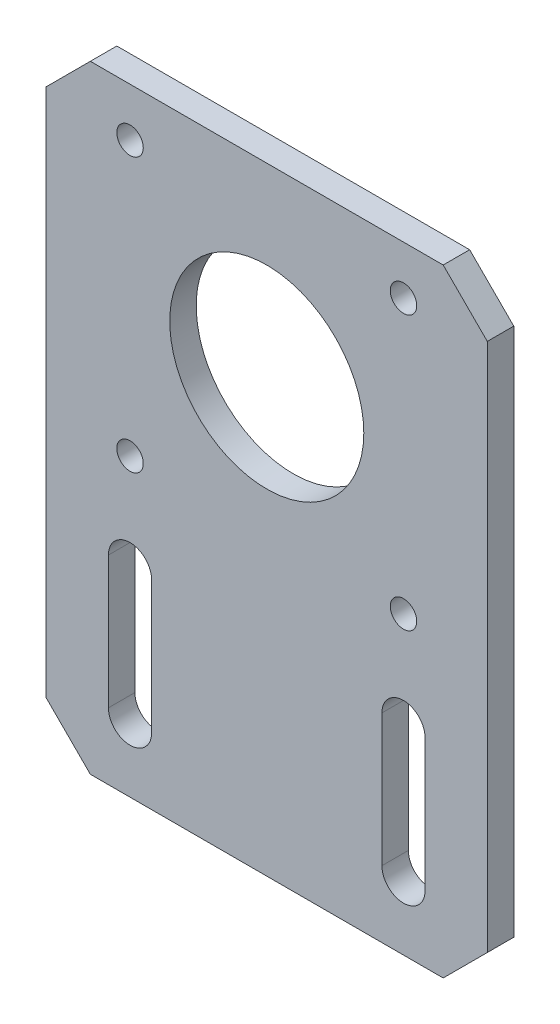
ISO-10303-21;
HEADER;
FILE_DESCRIPTION(('STEP AP214'),'2;1');
FILE_NAME('part.step','',(''),(''),'','','');
FILE_SCHEMA(('AUTOMOTIVE_DESIGN { 1 0 10303 214 1 1 1 1 }'));
ENDSEC;
DATA;
#1=APPLICATION_CONTEXT('core data for automotive mechanical design processes');
#2=APPLICATION_PROTOCOL_DEFINITION('international standard','automotive_design',2000,#1);
#3=PRODUCT_CONTEXT('',#1,'mechanical');
#4=PRODUCT('Part','Part','',(#3));
#5=PRODUCT_RELATED_PRODUCT_CATEGORY('part','',(#4));
#6=PRODUCT_DEFINITION_FORMATION('','',#4);
#7=PRODUCT_DEFINITION_CONTEXT('part definition',#1,'design');
#8=PRODUCT_DEFINITION('design','',#6,#7);
#9=PRODUCT_DEFINITION_SHAPE('','',#8);
#10=(LENGTH_UNIT() NAMED_UNIT(*) SI_UNIT(.MILLI.,.METRE.));
#11=(NAMED_UNIT(*) PLANE_ANGLE_UNIT() SI_UNIT($,.RADIAN.));
#12=(NAMED_UNIT(*) SI_UNIT($,.STERADIAN.) SOLID_ANGLE_UNIT());
#13=UNCERTAINTY_MEASURE_WITH_UNIT(LENGTH_MEASURE(1.E-05),#10,'distance_accuracy_value','');
#14=(GEOMETRIC_REPRESENTATION_CONTEXT(3) GLOBAL_UNCERTAINTY_ASSIGNED_CONTEXT((#13)) GLOBAL_UNIT_ASSIGNED_CONTEXT((#10,
#11,#12)) REPRESENTATION_CONTEXT('',''));
#15=CARTESIAN_POINT('',(0.,0.,0.));
#16=DIRECTION('',(0.,0.,1.));
#17=DIRECTION('',(1.,0.,0.));
#18=AXIS2_PLACEMENT_3D('',#15,#16,#17);
#19=CARTESIAN_POINT('',(0.,0.,3.));
#20=DIRECTION('',(0.,0.,1.));
#21=DIRECTION('',(1.,0.,0.));
#22=AXIS2_PLACEMENT_3D('',#19,#20,#21);
#23=PLANE('',#22);
#24=CARTESIAN_POINT('',(-15.5,-15.5,3.));
#25=DIRECTION('',(0.,0.,1.));
#26=DIRECTION('',(-1.,0.,0.));
#27=AXIS2_PLACEMENT_3D('',#24,#25,#26);
#28=CIRCLE('',#27,1.5);
#29=CARTESIAN_POINT('',(-17.,-15.5,3.));
#30=VERTEX_POINT('',#29);
#31=EDGE_CURVE('E224',#30,#30,#28,.T.);
#32=ORIENTED_EDGE('',*,*,#31,.F.);
#33=EDGE_LOOP('',(#32));
#34=FACE_BOUND('',#33,.T.);
#35=CARTESIAN_POINT('',(-15.5,15.5,3.));
#36=DIRECTION('',(0.,0.,1.));
#37=DIRECTION('',(1.,0.,0.));
#38=AXIS2_PLACEMENT_3D('',#35,#36,#37);
#39=CIRCLE('',#38,1.5);
#40=CARTESIAN_POINT('',(-14.,15.5,3.));
#41=VERTEX_POINT('',#40);
#42=EDGE_CURVE('E236',#41,#41,#39,.T.);
#43=ORIENTED_EDGE('',*,*,#42,.F.);
#44=EDGE_LOOP('',(#43));
#45=FACE_BOUND('',#44,.T.);
#46=DIRECTION('',(-0.707106781186548,0.707106781186548,0.));
#47=VECTOR('',#46,1.);
#48=CARTESIAN_POINT('',(25.,16.,3.));
#49=LINE('',#48,#47);
#50=CARTESIAN_POINT('',(25.,16.,3.));
#51=VERTEX_POINT('',#50);
#52=CARTESIAN_POINT('',(20.,21.,3.));
#53=VERTEX_POINT('',#52);
#54=EDGE_CURVE('E248',#51,#53,#49,.T.);
#55=ORIENTED_EDGE('',*,*,#54,.T.);
#56=DIRECTION('',(-1.,0.,0.));
#57=VECTOR('',#56,1.);
#58=CARTESIAN_POINT('',(20.,21.,3.));
#59=LINE('',#58,#57);
#60=CARTESIAN_POINT('',(-20.,21.,3.));
#61=VERTEX_POINT('',#60);
#62=EDGE_CURVE('E251',#53,#61,#59,.T.);
#63=ORIENTED_EDGE('',*,*,#62,.T.);
#64=DIRECTION('',(-0.707106781186547,-0.707106781186548,0.));
#65=VECTOR('',#64,1.);
#66=CARTESIAN_POINT('',(-20.,21.,3.));
#67=LINE('',#66,#65);
#68=CARTESIAN_POINT('',(-25.,16.,3.));
#69=VERTEX_POINT('',#68);
#70=EDGE_CURVE('E254',#61,#69,#67,.T.);
#71=ORIENTED_EDGE('',*,*,#70,.T.);
#72=DIRECTION('',(0.,-1.,0.));
#73=VECTOR('',#72,1.);
#74=CARTESIAN_POINT('',(-25.,-44.,3.));
#75=LINE('',#74,#73);
#76=CARTESIAN_POINT('',(-25.,-44.,3.));
#77=VERTEX_POINT('',#76);
#78=EDGE_CURVE('E256',#69,#77,#75,.T.);
#79=ORIENTED_EDGE('',*,*,#78,.T.);
#80=DIRECTION('',(0.707106781186548,-0.707106781186547,0.));
#81=VECTOR('',#80,1.);
#82=CARTESIAN_POINT('',(-20.,-49.,3.));
#83=LINE('',#82,#81);
#84=CARTESIAN_POINT('',(-20.,-49.,3.));
#85=VERTEX_POINT('',#84);
#86=EDGE_CURVE('E258',#77,#85,#83,.T.);
#87=ORIENTED_EDGE('',*,*,#86,.T.);
#88=DIRECTION('',(1.,0.,0.));
#89=VECTOR('',#88,1.);
#90=CARTESIAN_POINT('',(20.,-49.,3.));
#91=LINE('',#90,#89);
#92=CARTESIAN_POINT('',(20.,-49.,3.));
#93=VERTEX_POINT('',#92);
#94=EDGE_CURVE('E260',#85,#93,#91,.T.);
#95=ORIENTED_EDGE('',*,*,#94,.T.);
#96=DIRECTION('',(0.707106781186548,0.707106781186547,0.));
#97=VECTOR('',#96,1.);
#98=CARTESIAN_POINT('',(25.,-44.,3.));
#99=LINE('',#98,#97);
#100=CARTESIAN_POINT('',(25.,-44.,3.));
#101=VERTEX_POINT('',#100);
#102=EDGE_CURVE('E262',#93,#101,#99,.T.);
#103=ORIENTED_EDGE('',*,*,#102,.T.);
#104=DIRECTION('',(0.,1.,0.));
#105=VECTOR('',#104,1.);
#106=CARTESIAN_POINT('',(25.,-44.,3.));
#107=LINE('',#106,#105);
#108=EDGE_CURVE('E264',#101,#51,#107,.T.);
#109=ORIENTED_EDGE('',*,*,#108,.T.);
#110=EDGE_LOOP('',(#55,#63,#71,#79,#87,#95,#103,#109));
#111=FACE_BOUND('',#110,.T.);
#112=CARTESIAN_POINT('',(0.,0.,3.));
#113=DIRECTION('',(0.,0.,1.));
#114=DIRECTION('',(1.,0.,0.));
#115=AXIS2_PLACEMENT_3D('',#112,#113,#114);
#116=CIRCLE('',#115,11.);
#117=CARTESIAN_POINT('',(11.,0.,3.));
#118=VERTEX_POINT('',#117);
#119=EDGE_CURVE('E242',#118,#118,#116,.T.);
#120=ORIENTED_EDGE('',*,*,#119,.F.);
#121=EDGE_LOOP('',(#120));
#122=FACE_BOUND('',#121,.T.);
#123=CARTESIAN_POINT('',(15.5,15.5,3.));
#124=DIRECTION('',(0.,0.,1.));
#125=DIRECTION('',(-1.,0.,0.));
#126=AXIS2_PLACEMENT_3D('',#123,#124,#125);
#127=CIRCLE('',#126,1.5);
#128=CARTESIAN_POINT('',(14.,15.5,3.));
#129=VERTEX_POINT('',#128);
#130=EDGE_CURVE('E230',#129,#129,#127,.T.);
#131=ORIENTED_EDGE('',*,*,#130,.F.);
#132=EDGE_LOOP('',(#131));
#133=FACE_BOUND('',#132,.T.);
#134=CARTESIAN_POINT('',(15.5,-15.5,3.));
#135=DIRECTION('',(0.,0.,1.));
#136=DIRECTION('',(1.,0.,0.));
#137=AXIS2_PLACEMENT_3D('',#134,#135,#136);
#138=CIRCLE('',#137,1.5);
#139=CARTESIAN_POINT('',(17.,-15.5,3.));
#140=VERTEX_POINT('',#139);
#141=EDGE_CURVE('E218',#140,#140,#138,.T.);
#142=ORIENTED_EDGE('',*,*,#141,.F.);
#143=EDGE_LOOP('',(#142));
#144=FACE_BOUND('',#143,.T.);
#145=DIRECTION('',(0.,-1.,0.));
#146=VECTOR('',#145,1.);
#147=CARTESIAN_POINT('',(-17.95,-26.45,3.));
#148=LINE('',#147,#146);
#149=CARTESIAN_POINT('',(-17.95,-26.45,3.));
#150=VERTEX_POINT('',#149);
#151=CARTESIAN_POINT('',(-17.95,-41.45,3.));
#152=VERTEX_POINT('',#151);
#153=EDGE_CURVE('E189',#150,#152,#148,.T.);
#154=ORIENTED_EDGE('',*,*,#153,.F.);
#155=CARTESIAN_POINT('',(-15.5,-26.45,3.));
#156=DIRECTION('',(0.,0.,1.));
#157=DIRECTION('',(1.,0.,0.));
#158=AXIS2_PLACEMENT_3D('',#155,#156,#157);
#159=CIRCLE('',#158,2.45000000000001);
#160=CARTESIAN_POINT('',(-13.05,-26.45,3.));
#161=VERTEX_POINT('',#160);
#162=EDGE_CURVE('E187',#161,#150,#159,.T.);
#163=ORIENTED_EDGE('',*,*,#162,.F.);
#164=DIRECTION('',(0.,1.,0.));
#165=VECTOR('',#164,1.);
#166=CARTESIAN_POINT('',(-13.05,-26.45,3.));
#167=LINE('',#166,#165);
#168=CARTESIAN_POINT('',(-13.05,-41.45,3.));
#169=VERTEX_POINT('',#168);
#170=EDGE_CURVE('E195',#169,#161,#167,.T.);
#171=ORIENTED_EDGE('',*,*,#170,.F.);
#172=CARTESIAN_POINT('',(-15.5,-41.45,3.));
#173=DIRECTION('',(0.,0.,1.));
#174=DIRECTION('',(1.,0.,0.));
#175=AXIS2_PLACEMENT_3D('',#172,#173,#174);
#176=CIRCLE('',#175,2.45000000000002);
#177=EDGE_CURVE('E192',#152,#169,#176,.T.);
#178=ORIENTED_EDGE('',*,*,#177,.F.);
#179=EDGE_LOOP('',(#154,#163,#171,#178));
#180=FACE_BOUND('',#179,.T.);
#181=DIRECTION('',(0.,-1.,0.));
#182=VECTOR('',#181,1.);
#183=CARTESIAN_POINT('',(13.05,-26.45,3.));
#184=LINE('',#183,#182);
#185=CARTESIAN_POINT('',(13.05,-26.45,3.));
#186=VERTEX_POINT('',#185);
#187=CARTESIAN_POINT('',(13.05,-41.45,3.));
#188=VERTEX_POINT('',#187);
#189=EDGE_CURVE('E159',#186,#188,#184,.T.);
#190=ORIENTED_EDGE('',*,*,#189,.F.);
#191=CARTESIAN_POINT('',(15.5,-26.45,3.));
#192=DIRECTION('',(0.,0.,1.));
#193=DIRECTION('',(-1.,0.,0.));
#194=AXIS2_PLACEMENT_3D('',#191,#192,#193);
#195=CIRCLE('',#194,2.45000000000002);
#196=CARTESIAN_POINT('',(17.95,-26.45,3.));
#197=VERTEX_POINT('',#196);
#198=EDGE_CURVE('E151',#197,#186,#195,.T.);
#199=ORIENTED_EDGE('',*,*,#198,.F.);
#200=DIRECTION('',(0.,1.,0.));
#201=VECTOR('',#200,1.);
#202=CARTESIAN_POINT('',(17.95,-26.45,3.));
#203=LINE('',#202,#201);
#204=CARTESIAN_POINT('',(17.95,-41.45,3.));
#205=VERTEX_POINT('',#204);
#206=EDGE_CURVE('E173',#205,#197,#203,.T.);
#207=ORIENTED_EDGE('',*,*,#206,.F.);
#208=CARTESIAN_POINT('',(15.5,-41.45,3.));
#209=DIRECTION('',(0.,0.,1.));
#210=DIRECTION('',(-1.,0.,0.));
#211=AXIS2_PLACEMENT_3D('',#208,#209,#210);
#212=CIRCLE('',#211,2.45000000000002);
#213=EDGE_CURVE('E171',#188,#205,#212,.T.);
#214=ORIENTED_EDGE('',*,*,#213,.F.);
#215=EDGE_LOOP('',(#190,#199,#207,#214));
#216=FACE_BOUND('',#215,.T.);
#217=ADVANCED_FACE('F38',(#34,#45,#111,#122,#133,#144,#180,#216),#23,.T.);
#218=CARTESIAN_POINT('',(0.,0.,0.));
#219=DIRECTION('',(0.,0.,1.));
#220=DIRECTION('',(1.,0.,0.));
#221=AXIS2_PLACEMENT_3D('',#218,#219,#220);
#222=PLANE('',#221);
#223=CARTESIAN_POINT('',(-15.5,-26.45,0.));
#224=DIRECTION('',(0.,0.,1.));
#225=DIRECTION('',(1.,0.,0.));
#226=AXIS2_PLACEMENT_3D('',#223,#224,#225);
#227=CIRCLE('',#226,2.45000000000001);
#228=CARTESIAN_POINT('',(-13.05,-26.45,0.));
#229=VERTEX_POINT('',#228);
#230=CARTESIAN_POINT('',(-17.95,-26.45,0.));
#231=VERTEX_POINT('',#230);
#232=EDGE_CURVE('E167',#229,#231,#227,.T.);
#233=ORIENTED_EDGE('',*,*,#232,.T.);
#234=DIRECTION('',(0.,-1.,0.));
#235=VECTOR('',#234,1.);
#236=CARTESIAN_POINT('',(-17.95,-26.45,0.));
#237=LINE('',#236,#235);
#238=CARTESIAN_POINT('',(-17.95,-41.45,0.));
#239=VERTEX_POINT('',#238);
#240=EDGE_CURVE('E200',#231,#239,#237,.T.);
#241=ORIENTED_EDGE('',*,*,#240,.T.);
#242=CARTESIAN_POINT('',(-15.5,-41.45,0.));
#243=DIRECTION('',(0.,0.,1.));
#244=DIRECTION('',(1.,0.,0.));
#245=AXIS2_PLACEMENT_3D('',#242,#243,#244);
#246=CIRCLE('',#245,2.45000000000002);
#247=CARTESIAN_POINT('',(-13.05,-41.45,0.));
#248=VERTEX_POINT('',#247);
#249=EDGE_CURVE('E203',#239,#248,#246,.T.);
#250=ORIENTED_EDGE('',*,*,#249,.T.);
#251=DIRECTION('',(0.,1.,0.));
#252=VECTOR('',#251,1.);
#253=CARTESIAN_POINT('',(-13.05,-26.45,0.));
#254=LINE('',#253,#252);
#255=EDGE_CURVE('E190',#248,#229,#254,.T.);
#256=ORIENTED_EDGE('',*,*,#255,.T.);
#257=EDGE_LOOP('',(#233,#241,#250,#256));
#258=FACE_BOUND('',#257,.T.);
#259=DIRECTION('',(-0.707106781186548,0.707106781186548,0.));
#260=VECTOR('',#259,1.);
#261=CARTESIAN_POINT('',(25.,16.,0.));
#262=LINE('',#261,#260);
#263=CARTESIAN_POINT('',(25.,16.,0.));
#264=VERTEX_POINT('',#263);
#265=CARTESIAN_POINT('',(20.,21.,0.));
#266=VERTEX_POINT('',#265);
#267=EDGE_CURVE('E245',#264,#266,#262,.T.);
#268=ORIENTED_EDGE('',*,*,#267,.F.);
#269=DIRECTION('',(0.,1.,0.));
#270=VECTOR('',#269,1.);
#271=CARTESIAN_POINT('',(25.,-44.,0.));
#272=LINE('',#271,#270);
#273=CARTESIAN_POINT('',(25.,-44.,0.));
#274=VERTEX_POINT('',#273);
#275=EDGE_CURVE('E252',#274,#264,#272,.T.);
#276=ORIENTED_EDGE('',*,*,#275,.F.);
#277=DIRECTION('',(0.707106781186548,0.707106781186547,0.));
#278=VECTOR('',#277,1.);
#279=CARTESIAN_POINT('',(25.,-44.,0.));
#280=LINE('',#279,#278);
#281=CARTESIAN_POINT('',(20.,-49.,0.));
#282=VERTEX_POINT('',#281);
#283=EDGE_CURVE('E279',#282,#274,#280,.T.);
#284=ORIENTED_EDGE('',*,*,#283,.F.);
#285=DIRECTION('',(1.,0.,0.));
#286=VECTOR('',#285,1.);
#287=CARTESIAN_POINT('',(20.,-49.,0.));
#288=LINE('',#287,#286);
#289=CARTESIAN_POINT('',(-20.,-49.,0.));
#290=VERTEX_POINT('',#289);
#291=EDGE_CURVE('E277',#290,#282,#288,.T.);
#292=ORIENTED_EDGE('',*,*,#291,.F.);
#293=DIRECTION('',(0.707106781186548,-0.707106781186547,0.));
#294=VECTOR('',#293,1.);
#295=CARTESIAN_POINT('',(-20.,-49.,0.));
#296=LINE('',#295,#294);
#297=CARTESIAN_POINT('',(-25.,-44.,0.));
#298=VERTEX_POINT('',#297);
#299=EDGE_CURVE('E275',#298,#290,#296,.T.);
#300=ORIENTED_EDGE('',*,*,#299,.F.);
#301=DIRECTION('',(0.,-1.,0.));
#302=VECTOR('',#301,1.);
#303=CARTESIAN_POINT('',(-25.,-44.,0.));
#304=LINE('',#303,#302);
#305=CARTESIAN_POINT('',(-25.,16.,0.));
#306=VERTEX_POINT('',#305);
#307=EDGE_CURVE('E273',#306,#298,#304,.T.);
#308=ORIENTED_EDGE('',*,*,#307,.F.);
#309=DIRECTION('',(-0.707106781186547,-0.707106781186548,0.));
#310=VECTOR('',#309,1.);
#311=CARTESIAN_POINT('',(-20.,21.,0.));
#312=LINE('',#311,#310);
#313=CARTESIAN_POINT('',(-20.,21.,0.));
#314=VERTEX_POINT('',#313);
#315=EDGE_CURVE('E271',#314,#306,#312,.T.);
#316=ORIENTED_EDGE('',*,*,#315,.F.);
#317=DIRECTION('',(-1.,0.,0.));
#318=VECTOR('',#317,1.);
#319=CARTESIAN_POINT('',(20.,21.,0.));
#320=LINE('',#319,#318);
#321=EDGE_CURVE('E269',#266,#314,#320,.T.);
#322=ORIENTED_EDGE('',*,*,#321,.F.);
#323=EDGE_LOOP('',(#268,#276,#284,#292,#300,#308,#316,#322));
#324=FACE_BOUND('',#323,.T.);
#325=CARTESIAN_POINT('',(0.,0.,0.));
#326=DIRECTION('',(0.,0.,1.));
#327=DIRECTION('',(1.,0.,0.));
#328=AXIS2_PLACEMENT_3D('',#325,#326,#327);
#329=CIRCLE('',#328,11.);
#330=CARTESIAN_POINT('',(11.,0.,0.));
#331=VERTEX_POINT('',#330);
#332=EDGE_CURVE('E239',#331,#331,#329,.T.);
#333=ORIENTED_EDGE('',*,*,#332,.T.);
#334=EDGE_LOOP('',(#333));
#335=FACE_BOUND('',#334,.T.);
#336=CARTESIAN_POINT('',(-15.5,15.5,0.));
#337=DIRECTION('',(0.,0.,1.));
#338=DIRECTION('',(1.,0.,0.));
#339=AXIS2_PLACEMENT_3D('',#336,#337,#338);
#340=CIRCLE('',#339,1.5);
#341=CARTESIAN_POINT('',(-14.,15.5,0.));
#342=VERTEX_POINT('',#341);
#343=EDGE_CURVE('E233',#342,#342,#340,.T.);
#344=ORIENTED_EDGE('',*,*,#343,.T.);
#345=EDGE_LOOP('',(#344));
#346=FACE_BOUND('',#345,.T.);
#347=CARTESIAN_POINT('',(15.5,15.5,0.));
#348=DIRECTION('',(0.,0.,1.));
#349=DIRECTION('',(-1.,0.,0.));
#350=AXIS2_PLACEMENT_3D('',#347,#348,#349);
#351=CIRCLE('',#350,1.5);
#352=CARTESIAN_POINT('',(14.,15.5,0.));
#353=VERTEX_POINT('',#352);
#354=EDGE_CURVE('E227',#353,#353,#351,.T.);
#355=ORIENTED_EDGE('',*,*,#354,.T.);
#356=EDGE_LOOP('',(#355));
#357=FACE_BOUND('',#356,.T.);
#358=CARTESIAN_POINT('',(-15.5,-15.5,0.));
#359=DIRECTION('',(0.,0.,1.));
#360=DIRECTION('',(-1.,0.,0.));
#361=AXIS2_PLACEMENT_3D('',#358,#359,#360);
#362=CIRCLE('',#361,1.5);
#363=CARTESIAN_POINT('',(-17.,-15.5,0.));
#364=VERTEX_POINT('',#363);
#365=EDGE_CURVE('E221',#364,#364,#362,.T.);
#366=ORIENTED_EDGE('',*,*,#365,.T.);
#367=EDGE_LOOP('',(#366));
#368=FACE_BOUND('',#367,.T.);
#369=CARTESIAN_POINT('',(15.5,-15.5,0.));
#370=DIRECTION('',(0.,0.,1.));
#371=DIRECTION('',(1.,0.,0.));
#372=AXIS2_PLACEMENT_3D('',#369,#370,#371);
#373=CIRCLE('',#372,1.5);
#374=CARTESIAN_POINT('',(17.,-15.5,0.));
#375=VERTEX_POINT('',#374);
#376=EDGE_CURVE('E217',#375,#375,#373,.T.);
#377=ORIENTED_EDGE('',*,*,#376,.T.);
#378=EDGE_LOOP('',(#377));
#379=FACE_BOUND('',#378,.T.);
#380=CARTESIAN_POINT('',(15.5,-26.45,0.));
#381=DIRECTION('',(0.,0.,1.));
#382=DIRECTION('',(-1.,0.,0.));
#383=AXIS2_PLACEMENT_3D('',#380,#381,#382);
#384=CIRCLE('',#383,2.45000000000002);
#385=CARTESIAN_POINT('',(17.95,-26.45,0.));
#386=VERTEX_POINT('',#385);
#387=CARTESIAN_POINT('',(13.05,-26.45,0.));
#388=VERTEX_POINT('',#387);
#389=EDGE_CURVE('E61',#386,#388,#384,.T.);
#390=ORIENTED_EDGE('',*,*,#389,.T.);
#391=DIRECTION('',(0.,-1.,0.));
#392=VECTOR('',#391,1.);
#393=CARTESIAN_POINT('',(13.05,-26.45,0.));
#394=LINE('',#393,#392);
#395=CARTESIAN_POINT('',(13.05,-41.45,0.));
#396=VERTEX_POINT('',#395);
#397=EDGE_CURVE('E166',#388,#396,#394,.T.);
#398=ORIENTED_EDGE('',*,*,#397,.T.);
#399=CARTESIAN_POINT('',(15.5,-41.45,0.));
#400=DIRECTION('',(0.,0.,1.));
#401=DIRECTION('',(-1.,0.,0.));
#402=AXIS2_PLACEMENT_3D('',#399,#400,#401);
#403=CIRCLE('',#402,2.45000000000002);
#404=CARTESIAN_POINT('',(17.95,-41.45,0.));
#405=VERTEX_POINT('',#404);
#406=EDGE_CURVE('E179',#396,#405,#403,.T.);
#407=ORIENTED_EDGE('',*,*,#406,.T.);
#408=DIRECTION('',(0.,1.,0.));
#409=VECTOR('',#408,1.);
#410=CARTESIAN_POINT('',(17.95,-26.45,0.));
#411=LINE('',#410,#409);
#412=EDGE_CURVE('E160',#405,#386,#411,.T.);
#413=ORIENTED_EDGE('',*,*,#412,.T.);
#414=EDGE_LOOP('',(#390,#398,#407,#413));
#415=FACE_BOUND('',#414,.T.);
#416=ADVANCED_FACE('F309',(#258,#324,#335,#346,#357,#368,#379,#415),#222,.F.);
#417=CARTESIAN_POINT('',(25.,16.,3.));
#418=DIRECTION('',(-0.707106781186547,-0.707106781186547,0.));
#419=DIRECTION('',(0.707106781186548,-0.707106781186548,0.));
#420=AXIS2_PLACEMENT_3D('',#417,#418,#419);
#421=PLANE('',#420);
#422=ORIENTED_EDGE('',*,*,#267,.T.);
#423=DIRECTION('',(0.,0.,-1.));
#424=VECTOR('',#423,1.);
#425=CARTESIAN_POINT('',(20.,21.,3.));
#426=LINE('',#425,#424);
#427=EDGE_CURVE('E11',#53,#266,#426,.T.);
#428=ORIENTED_EDGE('',*,*,#427,.F.);
#429=ORIENTED_EDGE('',*,*,#54,.F.);
#430=DIRECTION('',(0.,0.,-1.));
#431=VECTOR('',#430,1.);
#432=CARTESIAN_POINT('',(25.,16.,3.));
#433=LINE('',#432,#431);
#434=EDGE_CURVE('E266',#51,#264,#433,.T.);
#435=ORIENTED_EDGE('',*,*,#434,.T.);
#436=EDGE_LOOP('',(#422,#428,#429,#435));
#437=FACE_BOUND('',#436,.T.);
#438=ADVANCED_FACE('F40',(#437),#421,.F.);
#439=CARTESIAN_POINT('',(20.,21.,3.));
#440=DIRECTION('',(0.,-1.,0.));
#441=DIRECTION('',(1.,0.,0.));
#442=AXIS2_PLACEMENT_3D('',#439,#440,#441);
#443=PLANE('',#442);
#444=ORIENTED_EDGE('',*,*,#321,.T.);
#445=DIRECTION('',(0.,0.,-1.));
#446=VECTOR('',#445,1.);
#447=CARTESIAN_POINT('',(-20.,21.,3.));
#448=LINE('',#447,#446);
#449=EDGE_CURVE('E46',#61,#314,#448,.T.);
#450=ORIENTED_EDGE('',*,*,#449,.F.);
#451=ORIENTED_EDGE('',*,*,#62,.F.);
#452=ORIENTED_EDGE('',*,*,#427,.T.);
#453=EDGE_LOOP('',(#444,#450,#451,#452));
#454=FACE_BOUND('',#453,.T.);
#455=ADVANCED_FACE('F327',(#454),#443,.F.);
#456=CARTESIAN_POINT('',(-20.,21.,3.));
#457=DIRECTION('',(0.707106781186548,-0.707106781186547,0.));
#458=DIRECTION('',(0.707106781186547,0.707106781186548,0.));
#459=AXIS2_PLACEMENT_3D('',#456,#457,#458);
#460=PLANE('',#459);
#461=ORIENTED_EDGE('',*,*,#315,.T.);
#462=DIRECTION('',(0.,0.,-1.));
#463=VECTOR('',#462,1.);
#464=CARTESIAN_POINT('',(-25.,16.,3.));
#465=LINE('',#464,#463);
#466=EDGE_CURVE('E296',#69,#306,#465,.T.);
#467=ORIENTED_EDGE('',*,*,#466,.F.);
#468=ORIENTED_EDGE('',*,*,#70,.F.);
#469=ORIENTED_EDGE('',*,*,#449,.T.);
#470=EDGE_LOOP('',(#461,#467,#468,#469));
#471=FACE_BOUND('',#470,.T.);
#472=ADVANCED_FACE('F303',(#471),#460,.F.);
#473=CARTESIAN_POINT('',(-25.,-44.,3.));
#474=DIRECTION('',(1.,0.,0.));
#475=DIRECTION('',(0.,1.,0.));
#476=AXIS2_PLACEMENT_3D('',#473,#474,#475);
#477=PLANE('',#476);
#478=ORIENTED_EDGE('',*,*,#307,.T.);
#479=DIRECTION('',(0.,0.,-1.));
#480=VECTOR('',#479,1.);
#481=CARTESIAN_POINT('',(-25.,-44.,3.));
#482=LINE('',#481,#480);
#483=EDGE_CURVE('E293',#77,#298,#482,.T.);
#484=ORIENTED_EDGE('',*,*,#483,.F.);
#485=ORIENTED_EDGE('',*,*,#78,.F.);
#486=ORIENTED_EDGE('',*,*,#466,.T.);
#487=EDGE_LOOP('',(#478,#484,#485,#486));
#488=FACE_BOUND('',#487,.T.);
#489=ADVANCED_FACE('F315',(#488),#477,.F.);
#490=CARTESIAN_POINT('',(-20.,-49.,3.));
#491=DIRECTION('',(0.707106781186547,0.707106781186548,0.));
#492=DIRECTION('',(-0.707106781186548,0.707106781186547,0.));
#493=AXIS2_PLACEMENT_3D('',#490,#491,#492);
#494=PLANE('',#493);
#495=ORIENTED_EDGE('',*,*,#299,.T.);
#496=DIRECTION('',(0.,0.,-1.));
#497=VECTOR('',#496,1.);
#498=CARTESIAN_POINT('',(-20.,-49.,3.));
#499=LINE('',#498,#497);
#500=EDGE_CURVE('E290',#85,#290,#499,.T.);
#501=ORIENTED_EDGE('',*,*,#500,.F.);
#502=ORIENTED_EDGE('',*,*,#86,.F.);
#503=ORIENTED_EDGE('',*,*,#483,.T.);
#504=EDGE_LOOP('',(#495,#501,#502,#503));
#505=FACE_BOUND('',#504,.T.);
#506=ADVANCED_FACE('F319',(#505),#494,.F.);
#507=CARTESIAN_POINT('',(20.,-49.,3.));
#508=DIRECTION('',(0.,1.,0.));
#509=DIRECTION('',(-1.,0.,0.));
#510=AXIS2_PLACEMENT_3D('',#507,#508,#509);
#511=PLANE('',#510);
#512=ORIENTED_EDGE('',*,*,#291,.T.);
#513=DIRECTION('',(0.,0.,-1.));
#514=VECTOR('',#513,1.);
#515=CARTESIAN_POINT('',(20.,-49.,3.));
#516=LINE('',#515,#514);
#517=EDGE_CURVE('E287',#93,#282,#516,.T.);
#518=ORIENTED_EDGE('',*,*,#517,.F.);
#519=ORIENTED_EDGE('',*,*,#94,.F.);
#520=ORIENTED_EDGE('',*,*,#500,.T.);
#521=EDGE_LOOP('',(#512,#518,#519,#520));
#522=FACE_BOUND('',#521,.T.);
#523=ADVANCED_FACE('F340',(#522),#511,.F.);
#524=CARTESIAN_POINT('',(25.,-44.,3.));
#525=DIRECTION('',(-0.707106781186547,0.707106781186548,0.));
#526=DIRECTION('',(-0.707106781186548,-0.707106781186547,0.));
#527=AXIS2_PLACEMENT_3D('',#524,#525,#526);
#528=PLANE('',#527);
#529=ORIENTED_EDGE('',*,*,#283,.T.);
#530=DIRECTION('',(0.,0.,-1.));
#531=VECTOR('',#530,1.);
#532=CARTESIAN_POINT('',(25.,-44.,3.));
#533=LINE('',#532,#531);
#534=EDGE_CURVE('E284',#101,#274,#533,.T.);
#535=ORIENTED_EDGE('',*,*,#534,.F.);
#536=ORIENTED_EDGE('',*,*,#102,.F.);
#537=ORIENTED_EDGE('',*,*,#517,.T.);
#538=EDGE_LOOP('',(#529,#535,#536,#537));
#539=FACE_BOUND('',#538,.T.);
#540=ADVANCED_FACE('F338',(#539),#528,.F.);
#541=CARTESIAN_POINT('',(25.,-44.,3.));
#542=DIRECTION('',(-1.,0.,0.));
#543=DIRECTION('',(0.,-1.,0.));
#544=AXIS2_PLACEMENT_3D('',#541,#542,#543);
#545=PLANE('',#544);
#546=ORIENTED_EDGE('',*,*,#275,.T.);
#547=ORIENTED_EDGE('',*,*,#434,.F.);
#548=ORIENTED_EDGE('',*,*,#108,.F.);
#549=ORIENTED_EDGE('',*,*,#534,.T.);
#550=EDGE_LOOP('',(#546,#547,#548,#549));
#551=FACE_BOUND('',#550,.T.);
#552=ADVANCED_FACE('F333',(#551),#545,.F.);
#553=CARTESIAN_POINT('',(0.,0.,3.));
#554=DIRECTION('',(0.,0.,-1.));
#555=DIRECTION('',(-1.,0.,0.));
#556=AXIS2_PLACEMENT_3D('',#553,#554,#555);
#557=CYLINDRICAL_SURFACE('',#556,11.);
#558=ORIENTED_EDGE('',*,*,#119,.T.);
#559=EDGE_LOOP('',(#558));
#560=FACE_BOUND('',#559,.T.);
#561=ORIENTED_EDGE('',*,*,#332,.F.);
#562=EDGE_LOOP('',(#561));
#563=FACE_BOUND('',#562,.T.);
#564=ADVANCED_FACE('F360',(#560,#563),#557,.F.);
#565=CARTESIAN_POINT('',(-15.5,15.5,3.));
#566=DIRECTION('',(0.,0.,-1.));
#567=DIRECTION('',(-1.,0.,0.));
#568=AXIS2_PLACEMENT_3D('',#565,#566,#567);
#569=CYLINDRICAL_SURFACE('',#568,1.5);
#570=ORIENTED_EDGE('',*,*,#42,.T.);
#571=EDGE_LOOP('',(#570));
#572=FACE_BOUND('',#571,.T.);
#573=ORIENTED_EDGE('',*,*,#343,.F.);
#574=EDGE_LOOP('',(#573));
#575=FACE_BOUND('',#574,.T.);
#576=ADVANCED_FACE('F367',(#572,#575),#569,.F.);
#577=CARTESIAN_POINT('',(15.5,15.5,3.));
#578=DIRECTION('',(0.,0.,-1.));
#579=DIRECTION('',(-1.,0.,0.));
#580=AXIS2_PLACEMENT_3D('',#577,#578,#579);
#581=CYLINDRICAL_SURFACE('',#580,1.5);
#582=ORIENTED_EDGE('',*,*,#130,.T.);
#583=EDGE_LOOP('',(#582));
#584=FACE_BOUND('',#583,.T.);
#585=ORIENTED_EDGE('',*,*,#354,.F.);
#586=EDGE_LOOP('',(#585));
#587=FACE_BOUND('',#586,.T.);
#588=ADVANCED_FACE('F372',(#584,#587),#581,.F.);
#589=CARTESIAN_POINT('',(-15.5,-15.5,3.));
#590=DIRECTION('',(0.,0.,-1.));
#591=DIRECTION('',(-1.,0.,0.));
#592=AXIS2_PLACEMENT_3D('',#589,#590,#591);
#593=CYLINDRICAL_SURFACE('',#592,1.5);
#594=ORIENTED_EDGE('',*,*,#31,.T.);
#595=EDGE_LOOP('',(#594));
#596=FACE_BOUND('',#595,.T.);
#597=ORIENTED_EDGE('',*,*,#365,.F.);
#598=EDGE_LOOP('',(#597));
#599=FACE_BOUND('',#598,.T.);
#600=ADVANCED_FACE('F420',(#596,#599),#593,.F.);
#601=CARTESIAN_POINT('',(15.5,-15.5,3.));
#602=DIRECTION('',(0.,0.,-1.));
#603=DIRECTION('',(-1.,0.,0.));
#604=AXIS2_PLACEMENT_3D('',#601,#602,#603);
#605=CYLINDRICAL_SURFACE('',#604,1.5);
#606=ORIENTED_EDGE('',*,*,#141,.T.);
#607=EDGE_LOOP('',(#606));
#608=FACE_BOUND('',#607,.T.);
#609=ORIENTED_EDGE('',*,*,#376,.F.);
#610=EDGE_LOOP('',(#609));
#611=FACE_BOUND('',#610,.T.);
#612=ADVANCED_FACE('F416',(#608,#611),#605,.F.);
#613=CARTESIAN_POINT('',(-15.5,-26.45,3.));
#614=DIRECTION('',(0.,0.,-1.));
#615=DIRECTION('',(-1.,0.,0.));
#616=AXIS2_PLACEMENT_3D('',#613,#614,#615);
#617=CYLINDRICAL_SURFACE('',#616,2.45000000000001);
#618=ORIENTED_EDGE('',*,*,#232,.F.);
#619=DIRECTION('',(0.,0.,-1.));
#620=VECTOR('',#619,1.);
#621=CARTESIAN_POINT('',(-13.05,-26.45,3.));
#622=LINE('',#621,#620);
#623=EDGE_CURVE('E197',#161,#229,#622,.T.);
#624=ORIENTED_EDGE('',*,*,#623,.F.);
#625=ORIENTED_EDGE('',*,*,#162,.T.);
#626=DIRECTION('',(0.,0.,-1.));
#627=VECTOR('',#626,1.);
#628=CARTESIAN_POINT('',(-17.95,-26.45,3.));
#629=LINE('',#628,#627);
#630=EDGE_CURVE('E214',#150,#231,#629,.T.);
#631=ORIENTED_EDGE('',*,*,#630,.T.);
#632=EDGE_LOOP('',(#618,#624,#625,#631));
#633=FACE_BOUND('',#632,.T.);
#634=ADVANCED_FACE('F412',(#633),#617,.F.);
#635=CARTESIAN_POINT('',(-17.95,-26.45,3.));
#636=DIRECTION('',(1.,0.,0.));
#637=DIRECTION('',(0.,0.,-1.));
#638=AXIS2_PLACEMENT_3D('',#635,#636,#637);
#639=PLANE('',#638);
#640=ORIENTED_EDGE('',*,*,#240,.F.);
#641=ORIENTED_EDGE('',*,*,#630,.F.);
#642=ORIENTED_EDGE('',*,*,#153,.T.);
#643=DIRECTION('',(0.,0.,-1.));
#644=VECTOR('',#643,1.);
#645=CARTESIAN_POINT('',(-17.95,-41.45,3.));
#646=LINE('',#645,#644);
#647=EDGE_CURVE('E212',#152,#239,#646,.T.);
#648=ORIENTED_EDGE('',*,*,#647,.T.);
#649=EDGE_LOOP('',(#640,#641,#642,#648));
#650=FACE_BOUND('',#649,.T.);
#651=ADVANCED_FACE('F408',(#650),#639,.T.);
#652=CARTESIAN_POINT('',(-15.5,-41.45,3.));
#653=DIRECTION('',(0.,0.,-1.));
#654=DIRECTION('',(-1.,0.,0.));
#655=AXIS2_PLACEMENT_3D('',#652,#653,#654);
#656=CYLINDRICAL_SURFACE('',#655,2.45000000000002);
#657=ORIENTED_EDGE('',*,*,#249,.F.);
#658=ORIENTED_EDGE('',*,*,#647,.F.);
#659=ORIENTED_EDGE('',*,*,#177,.T.);
#660=DIRECTION('',(0.,0.,-1.));
#661=VECTOR('',#660,1.);
#662=CARTESIAN_POINT('',(-13.05,-41.45,3.));
#663=LINE('',#662,#661);
#664=EDGE_CURVE('E210',#169,#248,#663,.T.);
#665=ORIENTED_EDGE('',*,*,#664,.T.);
#666=EDGE_LOOP('',(#657,#658,#659,#665));
#667=FACE_BOUND('',#666,.T.);
#668=ADVANCED_FACE('F404',(#667),#656,.F.);
#669=CARTESIAN_POINT('',(-13.05,-26.45,3.));
#670=DIRECTION('',(-1.,0.,0.));
#671=DIRECTION('',(0.,-1.,0.));
#672=AXIS2_PLACEMENT_3D('',#669,#670,#671);
#673=PLANE('',#672);
#674=ORIENTED_EDGE('',*,*,#255,.F.);
#675=ORIENTED_EDGE('',*,*,#664,.F.);
#676=ORIENTED_EDGE('',*,*,#170,.T.);
#677=ORIENTED_EDGE('',*,*,#623,.T.);
#678=EDGE_LOOP('',(#674,#675,#676,#677));
#679=FACE_BOUND('',#678,.T.);
#680=ADVANCED_FACE('F401',(#679),#673,.T.);
#681=CARTESIAN_POINT('',(15.5,-26.45,3.));
#682=DIRECTION('',(0.,0.,-1.));
#683=DIRECTION('',(-1.,0.,0.));
#684=AXIS2_PLACEMENT_3D('',#681,#682,#683);
#685=CYLINDRICAL_SURFACE('',#684,2.45000000000002);
#686=ORIENTED_EDGE('',*,*,#389,.F.);
#687=DIRECTION('',(0.,0.,-1.));
#688=VECTOR('',#687,1.);
#689=CARTESIAN_POINT('',(17.95,-26.45,3.));
#690=LINE('',#689,#688);
#691=EDGE_CURVE('E155',#197,#386,#690,.T.);
#692=ORIENTED_EDGE('',*,*,#691,.F.);
#693=ORIENTED_EDGE('',*,*,#198,.T.);
#694=DIRECTION('',(0.,0.,-1.));
#695=VECTOR('',#694,1.);
#696=CARTESIAN_POINT('',(13.05,-26.45,3.));
#697=LINE('',#696,#695);
#698=EDGE_CURVE('E154',#186,#388,#697,.T.);
#699=ORIENTED_EDGE('',*,*,#698,.T.);
#700=EDGE_LOOP('',(#686,#692,#693,#699));
#701=FACE_BOUND('',#700,.T.);
#702=ADVANCED_FACE('F153',(#701),#685,.F.);
#703=CARTESIAN_POINT('',(13.05,-26.45,3.));
#704=DIRECTION('',(1.,0.,0.));
#705=DIRECTION('',(0.,0.,-1.));
#706=AXIS2_PLACEMENT_3D('',#703,#704,#705);
#707=PLANE('',#706);
#708=ORIENTED_EDGE('',*,*,#397,.F.);
#709=ORIENTED_EDGE('',*,*,#698,.F.);
#710=ORIENTED_EDGE('',*,*,#189,.T.);
#711=DIRECTION('',(0.,0.,-1.));
#712=VECTOR('',#711,1.);
#713=CARTESIAN_POINT('',(13.05,-41.45,3.));
#714=LINE('',#713,#712);
#715=EDGE_CURVE('E168',#188,#396,#714,.T.);
#716=ORIENTED_EDGE('',*,*,#715,.T.);
#717=EDGE_LOOP('',(#708,#709,#710,#716));
#718=FACE_BOUND('',#717,.T.);
#719=ADVANCED_FACE('F163',(#718),#707,.T.);
#720=CARTESIAN_POINT('',(15.5,-41.45,3.));
#721=DIRECTION('',(0.,0.,-1.));
#722=DIRECTION('',(-1.,0.,0.));
#723=AXIS2_PLACEMENT_3D('',#720,#721,#722);
#724=CYLINDRICAL_SURFACE('',#723,2.45000000000002);
#725=ORIENTED_EDGE('',*,*,#406,.F.);
#726=ORIENTED_EDGE('',*,*,#715,.F.);
#727=ORIENTED_EDGE('',*,*,#213,.T.);
#728=DIRECTION('',(0.,0.,-1.));
#729=VECTOR('',#728,1.);
#730=CARTESIAN_POINT('',(17.95,-41.45,3.));
#731=LINE('',#730,#729);
#732=EDGE_CURVE('E53',#205,#405,#731,.T.);
#733=ORIENTED_EDGE('',*,*,#732,.T.);
#734=EDGE_LOOP('',(#725,#726,#727,#733));
#735=FACE_BOUND('',#734,.T.);
#736=ADVANCED_FACE('F389',(#735),#724,.F.);
#737=CARTESIAN_POINT('',(17.95,-26.45,3.));
#738=DIRECTION('',(-1.,0.,0.));
#739=DIRECTION('',(0.,0.,1.));
#740=AXIS2_PLACEMENT_3D('',#737,#738,#739);
#741=PLANE('',#740);
#742=ORIENTED_EDGE('',*,*,#412,.F.);
#743=ORIENTED_EDGE('',*,*,#732,.F.);
#744=ORIENTED_EDGE('',*,*,#206,.T.);
#745=ORIENTED_EDGE('',*,*,#691,.T.);
#746=EDGE_LOOP('',(#742,#743,#744,#745));
#747=FACE_BOUND('',#746,.T.);
#748=ADVANCED_FACE('F387',(#747),#741,.T.);
#749=CLOSED_SHELL('',(#217,#416,#438,#455,#472,#489,#506,#523,#540,#552,#564,#576,#588,#600,
#612,#634,#651,#668,#680,#702,#719,#736,#748));
#750=MANIFOLD_SOLID_BREP('B2',#749);
#751=ADVANCED_BREP_SHAPE_REPRESENTATION('',(#18,#750),#14);
#752=SHAPE_DEFINITION_REPRESENTATION(#9,#751);
ENDSEC;
END-ISO-10303-21;
